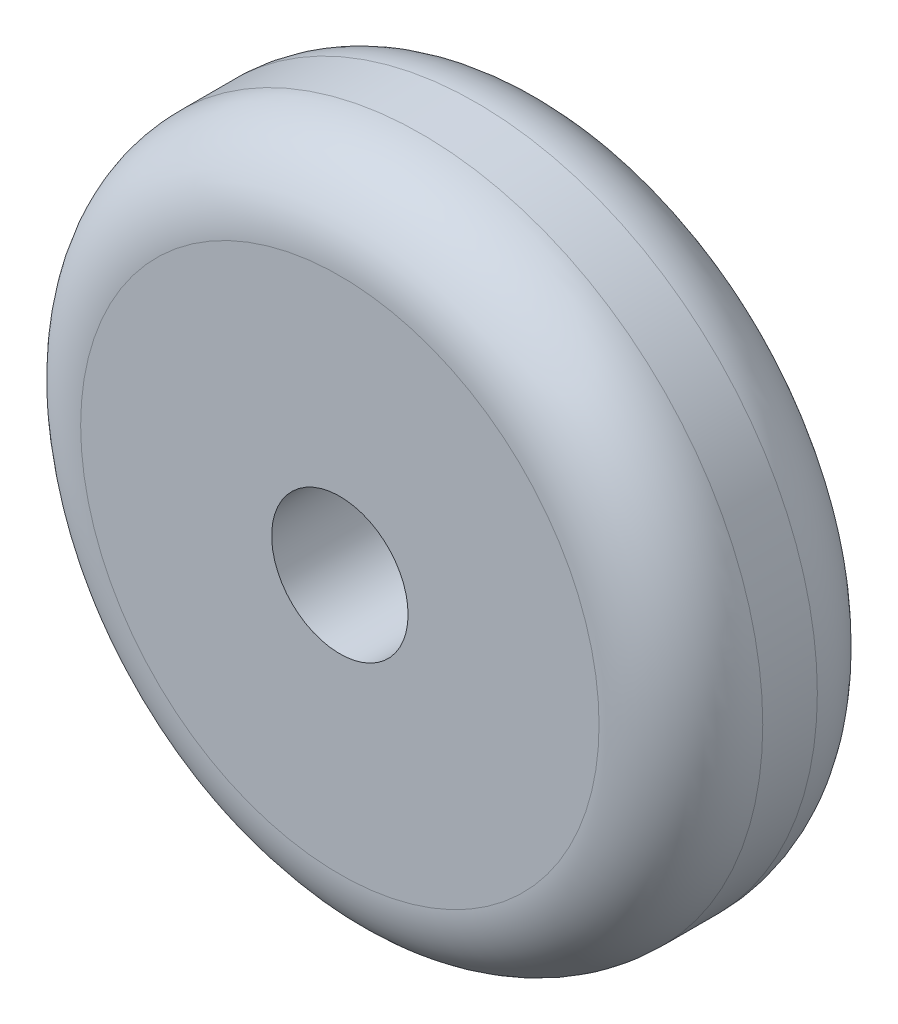
ISO-10303-21;
HEADER;
FILE_DESCRIPTION(('STEP AP214'),'2;1');
FILE_NAME('part.step','',(''),(''),'','','');
FILE_SCHEMA(('AUTOMOTIVE_DESIGN { 1 0 10303 214 1 1 1 1 }'));
ENDSEC;
DATA;
#1=APPLICATION_CONTEXT('core data for automotive mechanical design processes');
#2=APPLICATION_PROTOCOL_DEFINITION('international standard','automotive_design',2000,#1);
#3=PRODUCT_CONTEXT('',#1,'mechanical');
#4=PRODUCT('Part','Part','',(#3));
#5=PRODUCT_RELATED_PRODUCT_CATEGORY('part','',(#4));
#6=PRODUCT_DEFINITION_FORMATION('','',#4);
#7=PRODUCT_DEFINITION_CONTEXT('part definition',#1,'design');
#8=PRODUCT_DEFINITION('design','',#6,#7);
#9=PRODUCT_DEFINITION_SHAPE('','',#8);
#10=(LENGTH_UNIT() NAMED_UNIT(*) SI_UNIT(.MILLI.,.METRE.));
#11=(NAMED_UNIT(*) PLANE_ANGLE_UNIT() SI_UNIT($,.RADIAN.));
#12=(NAMED_UNIT(*) SI_UNIT($,.STERADIAN.) SOLID_ANGLE_UNIT());
#13=UNCERTAINTY_MEASURE_WITH_UNIT(LENGTH_MEASURE(1.E-05),#10,'distance_accuracy_value','');
#14=(GEOMETRIC_REPRESENTATION_CONTEXT(3) GLOBAL_UNCERTAINTY_ASSIGNED_CONTEXT((#13)) GLOBAL_UNIT_ASSIGNED_CONTEXT((#10,
#11,#12)) REPRESENTATION_CONTEXT('',''));
#15=CARTESIAN_POINT('',(0.,0.,0.));
#16=DIRECTION('',(0.,0.,1.));
#17=DIRECTION('',(1.,0.,0.));
#18=AXIS2_PLACEMENT_3D('',#15,#16,#17);
#19=CARTESIAN_POINT('',(0.,0.,4.));
#20=DIRECTION('',(0.,0.,1.));
#21=DIRECTION('',(1.,0.,0.));
#22=AXIS2_PLACEMENT_3D('',#19,#20,#21);
#23=PLANE('',#22);
#24=CARTESIAN_POINT('',(0.,0.,4.));
#25=DIRECTION('',(0.,0.,1.));
#26=DIRECTION('',(1.,0.,0.));
#27=AXIS2_PLACEMENT_3D('',#24,#25,#26);
#28=CIRCLE('',#27,9.5);
#29=CARTESIAN_POINT('',(9.5,0.,4.));
#30=VERTEX_POINT('',#29);
#31=EDGE_CURVE('E10',#30,#30,#28,.T.);
#32=ORIENTED_EDGE('',*,*,#31,.T.);
#33=EDGE_LOOP('',(#32));
#34=FACE_BOUND('',#33,.T.);
#35=CARTESIAN_POINT('',(0.,0.,4.));
#36=DIRECTION('',(0.,0.,1.));
#37=DIRECTION('',(1.,0.,0.));
#38=AXIS2_PLACEMENT_3D('',#35,#36,#37);
#39=CIRCLE('',#38,2.5);
#40=CARTESIAN_POINT('',(2.5,0.,4.));
#41=VERTEX_POINT('',#40);
#42=EDGE_CURVE('E61',#41,#41,#39,.T.);
#43=ORIENTED_EDGE('',*,*,#42,.F.);
#44=EDGE_LOOP('',(#43));
#45=FACE_BOUND('',#44,.T.);
#46=ADVANCED_FACE('F37',(#34,#45),#23,.T.);
#47=CARTESIAN_POINT('',(0.,0.,-4.));
#48=DIRECTION('',(0.,0.,1.));
#49=DIRECTION('',(1.,0.,0.));
#50=AXIS2_PLACEMENT_3D('',#47,#48,#49);
#51=PLANE('',#50);
#52=CARTESIAN_POINT('',(0.,0.,-4.));
#53=DIRECTION('',(0.,0.,1.));
#54=DIRECTION('',(1.,0.,0.));
#55=AXIS2_PLACEMENT_3D('',#52,#53,#54);
#56=CIRCLE('',#55,9.5);
#57=CARTESIAN_POINT('',(9.5,0.,-4.));
#58=VERTEX_POINT('',#57);
#59=EDGE_CURVE('E45',#58,#58,#56,.F.);
#60=ORIENTED_EDGE('',*,*,#59,.T.);
#61=EDGE_LOOP('',(#60));
#62=FACE_BOUND('',#61,.T.);
#63=CARTESIAN_POINT('',(0.,0.,-4.));
#64=DIRECTION('',(0.,0.,1.));
#65=DIRECTION('',(1.,0.,0.));
#66=AXIS2_PLACEMENT_3D('',#63,#64,#65);
#67=CIRCLE('',#66,2.5);
#68=CARTESIAN_POINT('',(2.5,0.,-4.));
#69=VERTEX_POINT('',#68);
#70=EDGE_CURVE('E62',#69,#69,#67,.T.);
#71=ORIENTED_EDGE('',*,*,#70,.T.);
#72=EDGE_LOOP('',(#71));
#73=FACE_BOUND('',#72,.T.);
#74=ADVANCED_FACE('F74',(#62,#73),#51,.F.);
#75=CARTESIAN_POINT('',(0.,0.,4.));
#76=DIRECTION('',(0.,0.,-1.));
#77=DIRECTION('',(-1.,0.,0.));
#78=AXIS2_PLACEMENT_3D('',#75,#76,#77);
#79=CYLINDRICAL_SURFACE('',#78,12.5);
#80=CARTESIAN_POINT('',(0.,0.,-1.));
#81=DIRECTION('',(0.,0.,1.));
#82=DIRECTION('',(1.,0.,0.));
#83=AXIS2_PLACEMENT_3D('',#80,#81,#82);
#84=CIRCLE('',#83,12.5);
#85=CARTESIAN_POINT('',(12.5,0.,-1.));
#86=VERTEX_POINT('',#85);
#87=EDGE_CURVE('E50',#86,#86,#84,.T.);
#88=ORIENTED_EDGE('',*,*,#87,.T.);
#89=EDGE_LOOP('',(#88));
#90=FACE_BOUND('',#89,.T.);
#91=CARTESIAN_POINT('',(0.,0.,1.));
#92=DIRECTION('',(0.,0.,1.));
#93=DIRECTION('',(1.,0.,0.));
#94=AXIS2_PLACEMENT_3D('',#91,#92,#93);
#95=CIRCLE('',#94,12.5);
#96=CARTESIAN_POINT('',(12.5,0.,1.));
#97=VERTEX_POINT('',#96);
#98=EDGE_CURVE('E55',#97,#97,#95,.F.);
#99=ORIENTED_EDGE('',*,*,#98,.T.);
#100=EDGE_LOOP('',(#99));
#101=FACE_BOUND('',#100,.T.);
#102=ADVANCED_FACE('F79',(#90,#101),#79,.T.);
#103=CARTESIAN_POINT('',(0.,0.,4.));
#104=DIRECTION('',(0.,0.,-1.));
#105=DIRECTION('',(-1.,0.,0.));
#106=AXIS2_PLACEMENT_3D('',#103,#104,#105);
#107=CYLINDRICAL_SURFACE('',#106,2.5);
#108=ORIENTED_EDGE('',*,*,#42,.T.);
#109=EDGE_LOOP('',(#108));
#110=FACE_BOUND('',#109,.T.);
#111=ORIENTED_EDGE('',*,*,#70,.F.);
#112=EDGE_LOOP('',(#111));
#113=FACE_BOUND('',#112,.T.);
#114=ADVANCED_FACE('F70',(#110,#113),#107,.F.);
#115=CARTESIAN_POINT('',(0.,0.,-1.));
#116=DIRECTION('',(0.,0.,1.));
#117=DIRECTION('',(1.,0.,0.));
#118=AXIS2_PLACEMENT_3D('',#115,#116,#117);
#119=TOROIDAL_SURFACE('',#118,9.5,3.);
#120=ORIENTED_EDGE('',*,*,#59,.F.);
#121=EDGE_LOOP('',(#120));
#122=FACE_BOUND('',#121,.T.);
#123=ORIENTED_EDGE('',*,*,#87,.F.);
#124=EDGE_LOOP('',(#123));
#125=FACE_BOUND('',#124,.T.);
#126=ADVANCED_FACE('F85',(#122,#125),#119,.T.);
#127=CARTESIAN_POINT('',(0.,0.,1.));
#128=DIRECTION('',(0.,0.,1.));
#129=DIRECTION('',(1.,0.,0.));
#130=AXIS2_PLACEMENT_3D('',#127,#128,#129);
#131=TOROIDAL_SURFACE('',#130,9.5,3.);
#132=ORIENTED_EDGE('',*,*,#98,.F.);
#133=EDGE_LOOP('',(#132));
#134=FACE_BOUND('',#133,.T.);
#135=ORIENTED_EDGE('',*,*,#31,.F.);
#136=EDGE_LOOP('',(#135));
#137=FACE_BOUND('',#136,.T.);
#138=ADVANCED_FACE('F39',(#134,#137),#131,.T.);
#139=CLOSED_SHELL('',(#46,#74,#102,#114,#126,#138));
#140=MANIFOLD_SOLID_BREP('B2',#139);
#141=ADVANCED_BREP_SHAPE_REPRESENTATION('',(#18,#140),#14);
#142=SHAPE_DEFINITION_REPRESENTATION(#9,#141);
ENDSEC;
END-ISO-10303-21;
